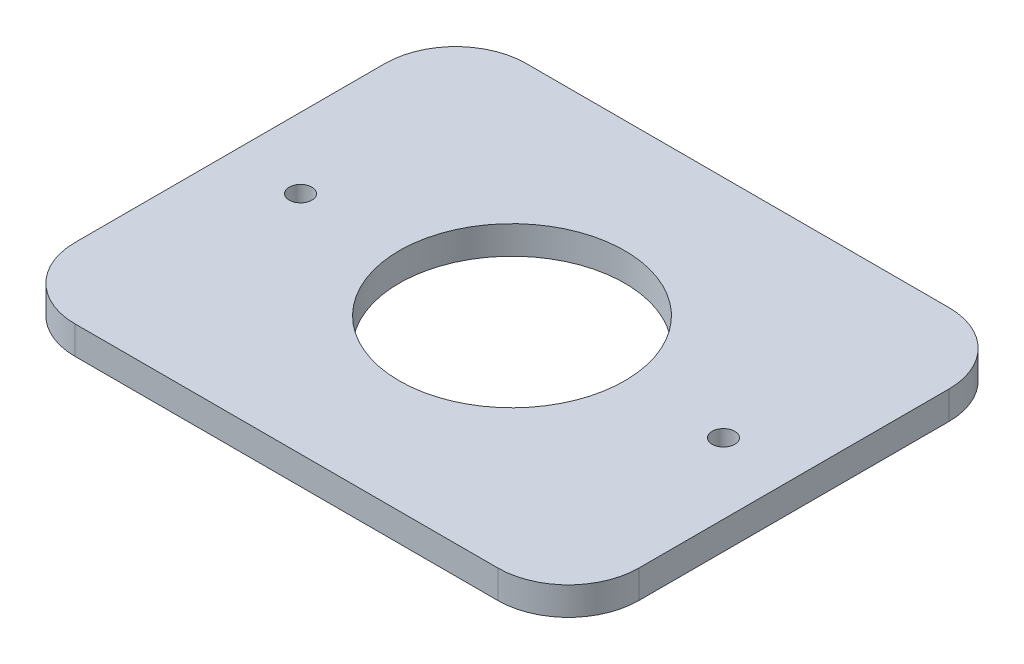
ISO-10303-21;
HEADER;
FILE_DESCRIPTION(('STEP AP214'),'2;1');
FILE_NAME('part.step','',(''),(''),'','','');
FILE_SCHEMA(('AUTOMOTIVE_DESIGN { 1 0 10303 214 1 1 1 1 }'));
ENDSEC;
DATA;
#1=APPLICATION_CONTEXT('core data for automotive mechanical design processes');
#2=APPLICATION_PROTOCOL_DEFINITION('international standard','automotive_design',2000,#1);
#3=PRODUCT_CONTEXT('',#1,'mechanical');
#4=PRODUCT('Part','Part','',(#3));
#5=PRODUCT_RELATED_PRODUCT_CATEGORY('part','',(#4));
#6=PRODUCT_DEFINITION_FORMATION('','',#4);
#7=PRODUCT_DEFINITION_CONTEXT('part definition',#1,'design');
#8=PRODUCT_DEFINITION('design','',#6,#7);
#9=PRODUCT_DEFINITION_SHAPE('','',#8);
#10=(LENGTH_UNIT() NAMED_UNIT(*) SI_UNIT(.MILLI.,.METRE.));
#11=(NAMED_UNIT(*) PLANE_ANGLE_UNIT() SI_UNIT($,.RADIAN.));
#12=(NAMED_UNIT(*) SI_UNIT($,.STERADIAN.) SOLID_ANGLE_UNIT());
#13=UNCERTAINTY_MEASURE_WITH_UNIT(LENGTH_MEASURE(1.E-05),#10,'distance_accuracy_value','');
#14=(GEOMETRIC_REPRESENTATION_CONTEXT(3) GLOBAL_UNCERTAINTY_ASSIGNED_CONTEXT((#13)) GLOBAL_UNIT_ASSIGNED_CONTEXT((#10,
#11,#12)) REPRESENTATION_CONTEXT('',''));
#15=CARTESIAN_POINT('',(0.,0.,0.));
#16=DIRECTION('',(0.,0.,1.));
#17=DIRECTION('',(1.,0.,0.));
#18=AXIS2_PLACEMENT_3D('',#15,#16,#17);
#19=CARTESIAN_POINT('',(0.,0.,0.));
#20=DIRECTION('',(0.,1.,0.));
#21=DIRECTION('',(0.,0.,1.));
#22=AXIS2_PLACEMENT_3D('',#19,#20,#21);
#23=PLANE('',#22);
#24=CARTESIAN_POINT('',(-15.,0.,0.));
#25=DIRECTION('',(0.,1.,0.));
#26=DIRECTION('',(0.,0.,1.));
#27=AXIS2_PLACEMENT_3D('',#24,#25,#26);
#28=CIRCLE('',#27,0.803797355944);
#29=CARTESIAN_POINT('',(-15.,0.,0.803797355944));
#30=VERTEX_POINT('',#29);
#31=EDGE_CURVE('E135',#30,#30,#28,.T.);
#32=ORIENTED_EDGE('',*,*,#31,.T.);
#33=EDGE_LOOP('',(#32));
#34=FACE_BOUND('',#33,.T.);
#35=CARTESIAN_POINT('',(15.,0.,0.));
#36=DIRECTION('',(0.,1.,0.));
#37=DIRECTION('',(0.,0.,1.));
#38=AXIS2_PLACEMENT_3D('',#35,#36,#37);
#39=CIRCLE('',#38,0.803797355944);
#40=CARTESIAN_POINT('',(15.,0.,0.803797355944));
#41=VERTEX_POINT('',#40);
#42=EDGE_CURVE('E138',#41,#41,#39,.T.);
#43=ORIENTED_EDGE('',*,*,#42,.T.);
#44=EDGE_LOOP('',(#43));
#45=FACE_BOUND('',#44,.T.);
#46=CARTESIAN_POINT('',(0.,0.,0.));
#47=DIRECTION('',(0.,1.,0.));
#48=DIRECTION('',(0.,0.,1.));
#49=AXIS2_PLACEMENT_3D('',#46,#47,#48);
#50=CIRCLE('',#49,8.);
#51=CARTESIAN_POINT('',(0.,0.,8.));
#52=VERTEX_POINT('',#51);
#53=EDGE_CURVE('E141',#52,#52,#50,.T.);
#54=ORIENTED_EDGE('',*,*,#53,.T.);
#55=EDGE_LOOP('',(#54));
#56=FACE_BOUND('',#55,.T.);
#57=CARTESIAN_POINT('',(-15.,0.,11.));
#58=DIRECTION('',(0.,-1.,0.));
#59=DIRECTION('',(0.,0.,-1.));
#60=AXIS2_PLACEMENT_3D('',#57,#58,#59);
#61=CIRCLE('',#60,5.);
#62=CARTESIAN_POINT('',(-20.,0.,11.));
#63=VERTEX_POINT('',#62);
#64=CARTESIAN_POINT('',(-15.,0.,16.));
#65=VERTEX_POINT('',#64);
#66=EDGE_CURVE('E147',#63,#65,#61,.F.);
#67=ORIENTED_EDGE('',*,*,#66,.F.);
#68=DIRECTION('',(0.,0.,1.));
#69=VECTOR('',#68,1.);
#70=CARTESIAN_POINT('',(-20.,0.,-16.));
#71=LINE('',#70,#69);
#72=CARTESIAN_POINT('',(-20.,0.,-11.));
#73=VERTEX_POINT('',#72);
#74=EDGE_CURVE('E113',#73,#63,#71,.T.);
#75=ORIENTED_EDGE('',*,*,#74,.F.);
#76=CARTESIAN_POINT('',(-15.,0.,-11.));
#77=DIRECTION('',(0.,-1.,0.));
#78=DIRECTION('',(0.,0.,-1.));
#79=AXIS2_PLACEMENT_3D('',#76,#77,#78);
#80=CIRCLE('',#79,5.);
#81=CARTESIAN_POINT('',(-15.,0.,-16.));
#82=VERTEX_POINT('',#81);
#83=EDGE_CURVE('E87',#82,#73,#80,.F.);
#84=ORIENTED_EDGE('',*,*,#83,.F.);
#85=DIRECTION('',(-1.,0.,0.));
#86=VECTOR('',#85,1.);
#87=CARTESIAN_POINT('',(20.,0.,-16.));
#88=LINE('',#87,#86);
#89=CARTESIAN_POINT('',(15.,0.,-16.));
#90=VERTEX_POINT('',#89);
#91=EDGE_CURVE('E82',#90,#82,#88,.T.);
#92=ORIENTED_EDGE('',*,*,#91,.F.);
#93=CARTESIAN_POINT('',(15.,0.,-11.));
#94=DIRECTION('',(0.,-1.,0.));
#95=DIRECTION('',(0.,0.,-1.));
#96=AXIS2_PLACEMENT_3D('',#93,#94,#95);
#97=CIRCLE('',#96,5.);
#98=CARTESIAN_POINT('',(20.,0.,-11.));
#99=VERTEX_POINT('',#98);
#100=EDGE_CURVE('E19',#99,#90,#97,.F.);
#101=ORIENTED_EDGE('',*,*,#100,.F.);
#102=DIRECTION('',(0.,0.,-1.));
#103=VECTOR('',#102,1.);
#104=CARTESIAN_POINT('',(20.,0.,16.));
#105=LINE('',#104,#103);
#106=CARTESIAN_POINT('',(20.,0.,11.));
#107=VERTEX_POINT('',#106);
#108=EDGE_CURVE('E77',#107,#99,#105,.T.);
#109=ORIENTED_EDGE('',*,*,#108,.F.);
#110=CARTESIAN_POINT('',(15.,0.,11.));
#111=DIRECTION('',(0.,-1.,0.));
#112=DIRECTION('',(0.,0.,-1.));
#113=AXIS2_PLACEMENT_3D('',#110,#111,#112);
#114=CIRCLE('',#113,5.);
#115=CARTESIAN_POINT('',(15.,0.,16.));
#116=VERTEX_POINT('',#115);
#117=EDGE_CURVE('E144',#116,#107,#114,.F.);
#118=ORIENTED_EDGE('',*,*,#117,.F.);
#119=DIRECTION('',(1.,0.,0.));
#120=VECTOR('',#119,1.);
#121=CARTESIAN_POINT('',(-20.,0.,16.));
#122=LINE('',#121,#120);
#123=EDGE_CURVE('E108',#65,#116,#122,.T.);
#124=ORIENTED_EDGE('',*,*,#123,.F.);
#125=EDGE_LOOP('',(#67,#75,#84,#92,#101,#109,#118,#124));
#126=FACE_BOUND('',#125,.T.);
#127=ADVANCED_FACE('F16',(#34,#45,#56,#126),#23,.F.);
#128=CARTESIAN_POINT('',(20.,0.,16.));
#129=DIRECTION('',(1.,0.,0.));
#130=DIRECTION('',(0.,0.,-1.));
#131=AXIS2_PLACEMENT_3D('',#128,#129,#130);
#132=PLANE('',#131);
#133=DIRECTION('',(0.,0.,1.));
#134=VECTOR('',#133,1.);
#135=CARTESIAN_POINT('',(20.,2.,0.));
#136=LINE('',#135,#134);
#137=CARTESIAN_POINT('',(20.,2.,11.));
#138=VERTEX_POINT('',#137);
#139=CARTESIAN_POINT('',(20.,2.,-11.));
#140=VERTEX_POINT('',#139);
#141=EDGE_CURVE('E134',#138,#140,#136,.F.);
#142=ORIENTED_EDGE('',*,*,#141,.F.);
#143=DIRECTION('',(0.,-1.,0.));
#144=VECTOR('',#143,1.);
#145=CARTESIAN_POINT('',(20.,2.01564799999999,11.));
#146=LINE('',#145,#144);
#147=EDGE_CURVE('E110',#107,#138,#146,.F.);
#148=ORIENTED_EDGE('',*,*,#147,.F.);
#149=ORIENTED_EDGE('',*,*,#108,.T.);
#150=DIRECTION('',(0.,-1.,0.));
#151=VECTOR('',#150,1.);
#152=CARTESIAN_POINT('',(20.,2.01564799999999,-11.));
#153=LINE('',#152,#151);
#154=EDGE_CURVE('E97',#140,#99,#153,.T.);
#155=ORIENTED_EDGE('',*,*,#154,.F.);
#156=EDGE_LOOP('',(#142,#148,#149,#155));
#157=FACE_BOUND('',#156,.T.);
#158=ADVANCED_FACE('F180',(#157),#132,.T.);
#159=CARTESIAN_POINT('',(15.,2.01564799999999,-11.));
#160=DIRECTION('',(0.,-1.,0.));
#161=DIRECTION('',(0.,0.,-1.));
#162=AXIS2_PLACEMENT_3D('',#159,#160,#161);
#163=CYLINDRICAL_SURFACE('',#162,5.);
#164=ORIENTED_EDGE('',*,*,#154,.T.);
#165=ORIENTED_EDGE('',*,*,#100,.T.);
#166=DIRECTION('',(0.,1.,0.));
#167=VECTOR('',#166,1.);
#168=CARTESIAN_POINT('',(15.,0.,-16.));
#169=LINE('',#168,#167);
#170=CARTESIAN_POINT('',(15.,2.,-16.));
#171=VERTEX_POINT('',#170);
#172=EDGE_CURVE('E91',#171,#90,#169,.F.);
#173=ORIENTED_EDGE('',*,*,#172,.F.);
#174=CARTESIAN_POINT('',(15.,2.,-11.));
#175=DIRECTION('',(0.,-1.,0.));
#176=DIRECTION('',(0.,0.,-1.));
#177=AXIS2_PLACEMENT_3D('',#174,#175,#176);
#178=CIRCLE('',#177,5.);
#179=EDGE_CURVE('E132',#140,#171,#178,.F.);
#180=ORIENTED_EDGE('',*,*,#179,.F.);
#181=EDGE_LOOP('',(#164,#165,#173,#180));
#182=FACE_BOUND('',#181,.T.);
#183=ADVANCED_FACE('F94',(#182),#163,.T.);
#184=CARTESIAN_POINT('',(20.,0.,-16.));
#185=DIRECTION('',(0.,0.,-1.));
#186=DIRECTION('',(-1.,0.,0.));
#187=AXIS2_PLACEMENT_3D('',#184,#185,#186);
#188=PLANE('',#187);
#189=DIRECTION('',(1.,0.,0.));
#190=VECTOR('',#189,1.);
#191=CARTESIAN_POINT('',(0.,2.,-16.));
#192=LINE('',#191,#190);
#193=CARTESIAN_POINT('',(-15.,2.,-16.));
#194=VERTEX_POINT('',#193);
#195=EDGE_CURVE('E100',#171,#194,#192,.F.);
#196=ORIENTED_EDGE('',*,*,#195,.F.);
#197=ORIENTED_EDGE('',*,*,#172,.T.);
#198=ORIENTED_EDGE('',*,*,#91,.T.);
#199=DIRECTION('',(0.,-1.,0.));
#200=VECTOR('',#199,1.);
#201=CARTESIAN_POINT('',(-15.,2.01564799999999,-16.));
#202=LINE('',#201,#200);
#203=EDGE_CURVE('E102',#194,#82,#202,.T.);
#204=ORIENTED_EDGE('',*,*,#203,.F.);
#205=EDGE_LOOP('',(#196,#197,#198,#204));
#206=FACE_BOUND('',#205,.T.);
#207=ADVANCED_FACE('F98',(#206),#188,.T.);
#208=CARTESIAN_POINT('',(-15.,2.01564799999999,-11.));
#209=DIRECTION('',(0.,-1.,0.));
#210=DIRECTION('',(0.,0.,-1.));
#211=AXIS2_PLACEMENT_3D('',#208,#209,#210);
#212=CYLINDRICAL_SURFACE('',#211,5.);
#213=ORIENTED_EDGE('',*,*,#203,.T.);
#214=ORIENTED_EDGE('',*,*,#83,.T.);
#215=DIRECTION('',(0.,1.,0.));
#216=VECTOR('',#215,1.);
#217=CARTESIAN_POINT('',(-20.,0.,-11.));
#218=LINE('',#217,#216);
#219=CARTESIAN_POINT('',(-20.,2.,-11.));
#220=VERTEX_POINT('',#219);
#221=EDGE_CURVE('E114',#220,#73,#218,.F.);
#222=ORIENTED_EDGE('',*,*,#221,.F.);
#223=CARTESIAN_POINT('',(-15.,2.,-11.));
#224=DIRECTION('',(0.,-1.,0.));
#225=DIRECTION('',(0.,0.,-1.));
#226=AXIS2_PLACEMENT_3D('',#223,#224,#225);
#227=CIRCLE('',#226,5.);
#228=EDGE_CURVE('E129',#194,#220,#227,.F.);
#229=ORIENTED_EDGE('',*,*,#228,.F.);
#230=EDGE_LOOP('',(#213,#214,#222,#229));
#231=FACE_BOUND('',#230,.T.);
#232=ADVANCED_FACE('F151',(#231),#212,.T.);
#233=CARTESIAN_POINT('',(-20.,0.,-16.));
#234=DIRECTION('',(-1.,0.,0.));
#235=DIRECTION('',(0.,0.,1.));
#236=AXIS2_PLACEMENT_3D('',#233,#234,#235);
#237=PLANE('',#236);
#238=DIRECTION('',(0.,0.,1.));
#239=VECTOR('',#238,1.);
#240=CARTESIAN_POINT('',(-20.,2.,0.));
#241=LINE('',#240,#239);
#242=CARTESIAN_POINT('',(-20.,2.,11.));
#243=VERTEX_POINT('',#242);
#244=EDGE_CURVE('E128',#220,#243,#241,.T.);
#245=ORIENTED_EDGE('',*,*,#244,.F.);
#246=ORIENTED_EDGE('',*,*,#221,.T.);
#247=ORIENTED_EDGE('',*,*,#74,.T.);
#248=DIRECTION('',(0.,-1.,0.));
#249=VECTOR('',#248,1.);
#250=CARTESIAN_POINT('',(-20.,2.01564799999999,11.));
#251=LINE('',#250,#249);
#252=EDGE_CURVE('E148',#243,#63,#251,.T.);
#253=ORIENTED_EDGE('',*,*,#252,.F.);
#254=EDGE_LOOP('',(#245,#246,#247,#253));
#255=FACE_BOUND('',#254,.T.);
#256=ADVANCED_FACE('F155',(#255),#237,.T.);
#257=CARTESIAN_POINT('',(-15.,2.01564799999999,11.));
#258=DIRECTION('',(0.,-1.,0.));
#259=DIRECTION('',(0.,0.,-1.));
#260=AXIS2_PLACEMENT_3D('',#257,#258,#259);
#261=CYLINDRICAL_SURFACE('',#260,5.);
#262=ORIENTED_EDGE('',*,*,#252,.T.);
#263=ORIENTED_EDGE('',*,*,#66,.T.);
#264=DIRECTION('',(0.,1.,0.));
#265=VECTOR('',#264,1.);
#266=CARTESIAN_POINT('',(-15.,0.,16.));
#267=LINE('',#266,#265);
#268=CARTESIAN_POINT('',(-15.,2.,16.));
#269=VERTEX_POINT('',#268);
#270=EDGE_CURVE('E111',#269,#65,#267,.F.);
#271=ORIENTED_EDGE('',*,*,#270,.F.);
#272=CARTESIAN_POINT('',(-15.,2.,11.));
#273=DIRECTION('',(0.,-1.,0.));
#274=DIRECTION('',(0.,0.,-1.));
#275=AXIS2_PLACEMENT_3D('',#272,#273,#274);
#276=CIRCLE('',#275,5.);
#277=EDGE_CURVE('E125',#243,#269,#276,.F.);
#278=ORIENTED_EDGE('',*,*,#277,.F.);
#279=EDGE_LOOP('',(#262,#263,#271,#278));
#280=FACE_BOUND('',#279,.T.);
#281=ADVANCED_FACE('F177',(#280),#261,.T.);
#282=CARTESIAN_POINT('',(-20.,0.,16.));
#283=DIRECTION('',(0.,0.,1.));
#284=DIRECTION('',(1.,0.,0.));
#285=AXIS2_PLACEMENT_3D('',#282,#283,#284);
#286=PLANE('',#285);
#287=ORIENTED_EDGE('',*,*,#123,.T.);
#288=DIRECTION('',(0.,-1.,0.));
#289=VECTOR('',#288,1.);
#290=CARTESIAN_POINT('',(15.,2.01564799999999,16.));
#291=LINE('',#290,#289);
#292=CARTESIAN_POINT('',(15.,2.,16.));
#293=VERTEX_POINT('',#292);
#294=EDGE_CURVE('E34',#293,#116,#291,.T.);
#295=ORIENTED_EDGE('',*,*,#294,.F.);
#296=DIRECTION('',(1.,0.,0.));
#297=VECTOR('',#296,1.);
#298=CARTESIAN_POINT('',(0.,2.,16.));
#299=LINE('',#298,#297);
#300=EDGE_CURVE('E124',#269,#293,#299,.T.);
#301=ORIENTED_EDGE('',*,*,#300,.F.);
#302=ORIENTED_EDGE('',*,*,#270,.T.);
#303=EDGE_LOOP('',(#287,#295,#301,#302));
#304=FACE_BOUND('',#303,.T.);
#305=ADVANCED_FACE('F173',(#304),#286,.T.);
#306=CARTESIAN_POINT('',(15.,2.01564799999999,11.));
#307=DIRECTION('',(0.,-1.,0.));
#308=DIRECTION('',(0.,0.,-1.));
#309=AXIS2_PLACEMENT_3D('',#306,#307,#308);
#310=CYLINDRICAL_SURFACE('',#309,5.);
#311=ORIENTED_EDGE('',*,*,#294,.T.);
#312=ORIENTED_EDGE('',*,*,#117,.T.);
#313=ORIENTED_EDGE('',*,*,#147,.T.);
#314=CARTESIAN_POINT('',(15.,2.,11.));
#315=DIRECTION('',(0.,-1.,0.));
#316=DIRECTION('',(0.,0.,-1.));
#317=AXIS2_PLACEMENT_3D('',#314,#315,#316);
#318=CIRCLE('',#317,5.);
#319=EDGE_CURVE('E121',#293,#138,#318,.F.);
#320=ORIENTED_EDGE('',*,*,#319,.F.);
#321=EDGE_LOOP('',(#311,#312,#313,#320));
#322=FACE_BOUND('',#321,.T.);
#323=ADVANCED_FACE('F179',(#322),#310,.T.);
#324=CARTESIAN_POINT('',(0.,2.,0.));
#325=DIRECTION('',(0.,1.,0.));
#326=DIRECTION('',(0.,0.,1.));
#327=AXIS2_PLACEMENT_3D('',#324,#325,#326);
#328=CYLINDRICAL_SURFACE('',#327,8.);
#329=CARTESIAN_POINT('',(0.,2.,0.));
#330=DIRECTION('',(0.,1.,0.));
#331=DIRECTION('',(0.,0.,1.));
#332=AXIS2_PLACEMENT_3D('',#329,#330,#331);
#333=CIRCLE('',#332,8.);
#334=CARTESIAN_POINT('',(0.,2.,8.));
#335=VERTEX_POINT('',#334);
#336=EDGE_CURVE('E118',#335,#335,#333,.F.);
#337=ORIENTED_EDGE('',*,*,#336,.F.);
#338=EDGE_LOOP('',(#337));
#339=FACE_BOUND('',#338,.T.);
#340=ORIENTED_EDGE('',*,*,#53,.F.);
#341=EDGE_LOOP('',(#340));
#342=FACE_BOUND('',#341,.T.);
#343=ADVANCED_FACE('F203',(#339,#342),#328,.F.);
#344=CARTESIAN_POINT('',(15.,2.,0.));
#345=DIRECTION('',(0.,1.,0.));
#346=DIRECTION('',(0.,0.,1.));
#347=AXIS2_PLACEMENT_3D('',#344,#345,#346);
#348=CYLINDRICAL_SURFACE('',#347,0.803797355944);
#349=CARTESIAN_POINT('',(15.,2.,0.));
#350=DIRECTION('',(0.,1.,0.));
#351=DIRECTION('',(0.,0.,1.));
#352=AXIS2_PLACEMENT_3D('',#349,#350,#351);
#353=CIRCLE('',#352,0.803797355944);
#354=CARTESIAN_POINT('',(15.,2.,0.803797355944));
#355=VERTEX_POINT('',#354);
#356=EDGE_CURVE('E25',#355,#355,#353,.F.);
#357=ORIENTED_EDGE('',*,*,#356,.F.);
#358=EDGE_LOOP('',(#357));
#359=FACE_BOUND('',#358,.T.);
#360=ORIENTED_EDGE('',*,*,#42,.F.);
#361=EDGE_LOOP('',(#360));
#362=FACE_BOUND('',#361,.T.);
#363=ADVANCED_FACE('F196',(#359,#362),#348,.F.);
#364=CARTESIAN_POINT('',(-15.,2.,0.));
#365=DIRECTION('',(0.,1.,0.));
#366=DIRECTION('',(0.,0.,1.));
#367=AXIS2_PLACEMENT_3D('',#364,#365,#366);
#368=CYLINDRICAL_SURFACE('',#367,0.803797355944);
#369=CARTESIAN_POINT('',(-15.,2.,0.));
#370=DIRECTION('',(0.,1.,0.));
#371=DIRECTION('',(0.,0.,1.));
#372=AXIS2_PLACEMENT_3D('',#369,#370,#371);
#373=CIRCLE('',#372,0.803797355944);
#374=CARTESIAN_POINT('',(-15.,2.,0.803797355944));
#375=VERTEX_POINT('',#374);
#376=EDGE_CURVE('E11',#375,#375,#373,.F.);
#377=ORIENTED_EDGE('',*,*,#376,.F.);
#378=EDGE_LOOP('',(#377));
#379=FACE_BOUND('',#378,.T.);
#380=ORIENTED_EDGE('',*,*,#31,.F.);
#381=EDGE_LOOP('',(#380));
#382=FACE_BOUND('',#381,.T.);
#383=ADVANCED_FACE('F190',(#379,#382),#368,.F.);
#384=CARTESIAN_POINT('',(0.,2.,0.));
#385=DIRECTION('',(0.,1.,0.));
#386=DIRECTION('',(0.,0.,1.));
#387=AXIS2_PLACEMENT_3D('',#384,#385,#386);
#388=PLANE('',#387);
#389=ORIENTED_EDGE('',*,*,#376,.T.);
#390=EDGE_LOOP('',(#389));
#391=FACE_BOUND('',#390,.T.);
#392=ORIENTED_EDGE('',*,*,#356,.T.);
#393=EDGE_LOOP('',(#392));
#394=FACE_BOUND('',#393,.T.);
#395=ORIENTED_EDGE('',*,*,#336,.T.);
#396=EDGE_LOOP('',(#395));
#397=FACE_BOUND('',#396,.T.);
#398=ORIENTED_EDGE('',*,*,#300,.T.);
#399=ORIENTED_EDGE('',*,*,#319,.T.);
#400=ORIENTED_EDGE('',*,*,#141,.T.);
#401=ORIENTED_EDGE('',*,*,#179,.T.);
#402=ORIENTED_EDGE('',*,*,#195,.T.);
#403=ORIENTED_EDGE('',*,*,#228,.T.);
#404=ORIENTED_EDGE('',*,*,#244,.T.);
#405=ORIENTED_EDGE('',*,*,#277,.T.);
#406=EDGE_LOOP('',(#398,#399,#400,#401,#402,#403,#404,#405));
#407=FACE_BOUND('',#406,.T.);
#408=ADVANCED_FACE('F171',(#391,#394,#397,#407),#388,.T.);
#409=CLOSED_SHELL('',(#127,#158,#183,#207,#232,#256,#281,#305,#323,#343,#363,#383,#408));
#410=MANIFOLD_SOLID_BREP('B1',#409);
#411=ADVANCED_BREP_SHAPE_REPRESENTATION('',(#18,#410),#14);
#412=SHAPE_DEFINITION_REPRESENTATION(#9,#411);
ENDSEC;
END-ISO-10303-21;
